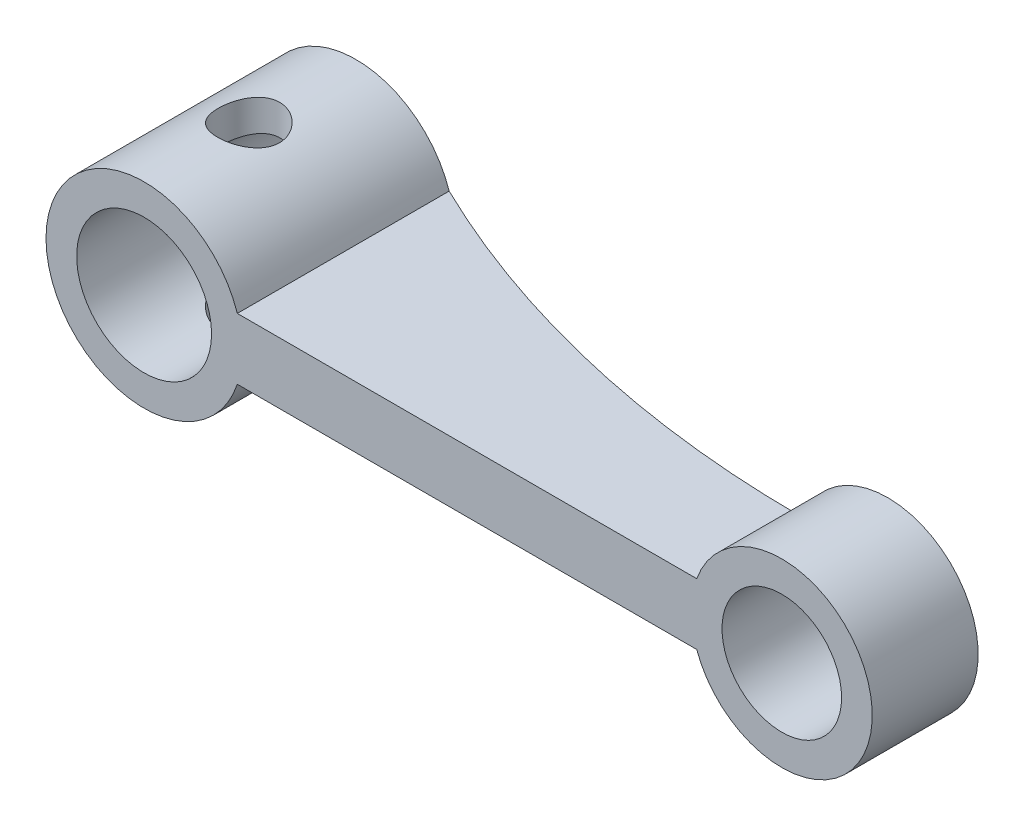
ISO-10303-21;
HEADER;
FILE_DESCRIPTION(('STEP AP214'),'2;1');
FILE_NAME('part.step','',(''),(''),'','','');
FILE_SCHEMA(('AUTOMOTIVE_DESIGN { 1 0 10303 214 1 1 1 1 }'));
ENDSEC;
DATA;
#1=APPLICATION_CONTEXT('core data for automotive mechanical design processes');
#2=APPLICATION_PROTOCOL_DEFINITION('international standard','automotive_design',2000,#1);
#3=PRODUCT_CONTEXT('',#1,'mechanical');
#4=PRODUCT('Part','Part','',(#3));
#5=PRODUCT_RELATED_PRODUCT_CATEGORY('part','',(#4));
#6=PRODUCT_DEFINITION_FORMATION('','',#4);
#7=PRODUCT_DEFINITION_CONTEXT('part definition',#1,'design');
#8=PRODUCT_DEFINITION('design','',#6,#7);
#9=PRODUCT_DEFINITION_SHAPE('','',#8);
#10=(LENGTH_UNIT() NAMED_UNIT(*) SI_UNIT(.MILLI.,.METRE.));
#11=(NAMED_UNIT(*) PLANE_ANGLE_UNIT() SI_UNIT($,.RADIAN.));
#12=(NAMED_UNIT(*) SI_UNIT($,.STERADIAN.) SOLID_ANGLE_UNIT());
#13=UNCERTAINTY_MEASURE_WITH_UNIT(LENGTH_MEASURE(1.E-05),#10,'distance_accuracy_value','');
#14=(GEOMETRIC_REPRESENTATION_CONTEXT(3) GLOBAL_UNCERTAINTY_ASSIGNED_CONTEXT((#13)) GLOBAL_UNIT_ASSIGNED_CONTEXT((#10,
#11,#12)) REPRESENTATION_CONTEXT('',''));
#15=CARTESIAN_POINT('',(0.,0.,0.));
#16=DIRECTION('',(0.,0.,1.));
#17=DIRECTION('',(1.,0.,0.));
#18=AXIS2_PLACEMENT_3D('',#15,#16,#17);
#19=CARTESIAN_POINT('',(-20.8,0.,6.91));
#20=DIRECTION('',(0.,0.,1.));
#21=DIRECTION('',(1.,0.,0.));
#22=AXIS2_PLACEMENT_3D('',#19,#20,#21);
#23=PLANE('',#22);
#24=CARTESIAN_POINT('',(0.,0.,6.91));
#25=DIRECTION('',(0.,0.,1.));
#26=DIRECTION('',(1.,0.,0.));
#27=AXIS2_PLACEMENT_3D('',#24,#25,#26);
#28=CIRCLE('',#27,1.95);
#29=CARTESIAN_POINT('',(1.95,0.,6.91));
#30=VERTEX_POINT('',#29);
#31=EDGE_CURVE('E105',#30,#30,#28,.T.);
#32=ORIENTED_EDGE('',*,*,#31,.F.);
#33=EDGE_LOOP('',(#32));
#34=FACE_BOUND('',#33,.T.);
#35=CARTESIAN_POINT('',(-20.8,0.,6.91));
#36=DIRECTION('',(0.,0.,1.));
#37=DIRECTION('',(1.,0.,0.));
#38=AXIS2_PLACEMENT_3D('',#35,#36,#37);
#39=CIRCLE('',#38,3.2);
#40=CARTESIAN_POINT('',(-17.7602631692859,0.999999999999996,6.91));
#41=VERTEX_POINT('',#40);
#42=CARTESIAN_POINT('',(-17.7602631692859,-1.,6.91));
#43=VERTEX_POINT('',#42);
#44=EDGE_CURVE('E104',#41,#43,#39,.T.);
#45=ORIENTED_EDGE('',*,*,#44,.T.);
#46=DIRECTION('',(1.,0.,0.));
#47=VECTOR('',#46,1.);
#48=CARTESIAN_POINT('',(-17.7602631692859,-1.,6.91));
#49=LINE('',#48,#47);
#50=CARTESIAN_POINT('',(-2.77533781727558,-1.,6.91));
#51=VERTEX_POINT('',#50);
#52=EDGE_CURVE('E97',#43,#51,#49,.T.);
#53=ORIENTED_EDGE('',*,*,#52,.T.);
#54=CARTESIAN_POINT('',(0.,0.,6.91));
#55=DIRECTION('',(0.,0.,1.));
#56=DIRECTION('',(1.,0.,0.));
#57=AXIS2_PLACEMENT_3D('',#54,#55,#56);
#58=CIRCLE('',#57,2.95);
#59=CARTESIAN_POINT('',(-2.77533781727558,0.999999999999998,6.91));
#60=VERTEX_POINT('',#59);
#61=EDGE_CURVE('E158',#51,#60,#58,.T.);
#62=ORIENTED_EDGE('',*,*,#61,.T.);
#63=DIRECTION('',(-1.,0.,0.));
#64=VECTOR('',#63,1.);
#65=CARTESIAN_POINT('',(-17.7602631692859,0.999999999999996,6.91));
#66=LINE('',#65,#64);
#67=EDGE_CURVE('E52',#60,#41,#66,.T.);
#68=ORIENTED_EDGE('',*,*,#67,.T.);
#69=EDGE_LOOP('',(#45,#53,#62,#68));
#70=FACE_BOUND('',#69,.T.);
#71=CARTESIAN_POINT('',(-20.8,0.,6.91));
#72=DIRECTION('',(0.,0.,1.));
#73=DIRECTION('',(1.,0.,0.));
#74=AXIS2_PLACEMENT_3D('',#71,#72,#73);
#75=CIRCLE('',#74,2.2);
#76=CARTESIAN_POINT('',(-18.6,0.,6.91));
#77=VERTEX_POINT('',#76);
#78=EDGE_CURVE('E109',#77,#77,#75,.T.);
#79=ORIENTED_EDGE('',*,*,#78,.F.);
#80=EDGE_LOOP('',(#79));
#81=FACE_BOUND('',#80,.T.);
#82=ADVANCED_FACE('F35',(#34,#70,#81),#23,.T.);
#83=CARTESIAN_POINT('',(-20.8,0.,0.));
#84=DIRECTION('',(0.,0.,1.));
#85=DIRECTION('',(1.,0.,0.));
#86=AXIS2_PLACEMENT_3D('',#83,#84,#85);
#87=PLANE('',#86);
#88=CARTESIAN_POINT('',(-20.8,0.,0.));
#89=DIRECTION('',(0.,0.,1.));
#90=DIRECTION('',(1.,0.,0.));
#91=AXIS2_PLACEMENT_3D('',#88,#89,#90);
#92=CIRCLE('',#91,3.2);
#93=CARTESIAN_POINT('',(-17.7602631692859,0.999999999999996,0.));
#94=VERTEX_POINT('',#93);
#95=CARTESIAN_POINT('',(-17.7602631692859,-1.,0.));
#96=VERTEX_POINT('',#95);
#97=EDGE_CURVE('E93',#94,#96,#92,.T.);
#98=ORIENTED_EDGE('',*,*,#97,.F.);
#99=DIRECTION('',(0.,-1.,0.));
#100=VECTOR('',#99,1.);
#101=CARTESIAN_POINT('',(-17.7602631692859,4.,0.));
#102=LINE('',#101,#100);
#103=EDGE_CURVE('E78',#94,#96,#102,.T.);
#104=ORIENTED_EDGE('',*,*,#103,.T.);
#105=EDGE_LOOP('',(#98,#104));
#106=FACE_BOUND('',#105,.T.);
#107=CARTESIAN_POINT('',(-20.8,0.,0.));
#108=DIRECTION('',(0.,0.,1.));
#109=DIRECTION('',(1.,0.,0.));
#110=AXIS2_PLACEMENT_3D('',#107,#108,#109);
#111=CIRCLE('',#110,2.2);
#112=CARTESIAN_POINT('',(-18.6,0.,0.));
#113=VERTEX_POINT('',#112);
#114=EDGE_CURVE('E153',#113,#113,#111,.T.);
#115=ORIENTED_EDGE('',*,*,#114,.T.);
#116=EDGE_LOOP('',(#115));
#117=FACE_BOUND('',#116,.T.);
#118=ADVANCED_FACE('F90',(#106,#117),#87,.F.);
#119=CARTESIAN_POINT('',(-20.8,0.,6.91));
#120=DIRECTION('',(0.,0.,-1.));
#121=DIRECTION('',(-1.,0.,0.));
#122=AXIS2_PLACEMENT_3D('',#119,#120,#121);
#123=CYLINDRICAL_SURFACE('',#122,3.2);
#124=CARTESIAN_POINT('',(-19.8400657923215,3.052626134483,3.455));
#125=CARTESIAN_POINT('',(-19.8400661769432,3.05262647572289,3.50981856955722));
#126=CARTESIAN_POINT('',(-19.8445883980328,3.05405942740162,3.56464101394872));
#127=CARTESIAN_POINT('',(-19.8625097001257,3.05960742733841,3.67267971879201));
#128=CARTESIAN_POINT('',(-19.8759111126392,3.06372318004542,3.72589555353965));
#129=CARTESIAN_POINT('',(-19.9110954070628,3.07411476593088,3.82914513799746));
#130=CARTESIAN_POINT('',(-19.9328644453536,3.08038702952191,3.87918398531369));
#131=CARTESIAN_POINT('',(-19.9841235768237,3.09435755485059,3.97491599807191));
#132=CARTESIAN_POINT('',(-20.0136149677394,3.1020560562029,4.02060843134075));
#133=CARTESIAN_POINT('',(-20.0804923083181,3.1182564677877,4.10780419308635));
#134=CARTESIAN_POINT('',(-20.1180815800673,3.12677515513293,4.14914851333053));
#135=CARTESIAN_POINT('',(-20.1996561566823,3.14345637869388,4.22505195221916));
#136=CARTESIAN_POINT('',(-20.2436422139722,3.15161887286522,4.25961027153259));
#137=CARTESIAN_POINT('',(-20.3378070215103,3.16681091678736,4.32158635740912));
#138=CARTESIAN_POINT('',(-20.3880875200189,3.1738160047655,4.34885604136949));
#139=CARTESIAN_POINT('',(-20.4927762904632,3.18565277368981,4.39449363236464));
#140=CARTESIAN_POINT('',(-20.5471835580827,3.19048498147088,4.41286369727804));
#141=CARTESIAN_POINT('',(-20.6567568525249,3.19724856887244,4.43962058957542));
#142=CARTESIAN_POINT('',(-20.7118452649788,3.19926636086753,4.44830308691116));
#143=CARTESIAN_POINT('',(-20.8227233117708,3.20039915616633,4.45639273232988));
#144=CARTESIAN_POINT('',(-20.8785127984531,3.1995147608313,4.45580180186076));
#145=CARTESIAN_POINT('',(-20.9873343408336,3.19496161976434,4.44555772047764));
#146=CARTESIAN_POINT('',(-21.0403977020862,3.19138218166585,4.43619293234799));
#147=CARTESIAN_POINT('',(-21.1441383626561,3.18186797736564,4.40915616293206));
#148=CARTESIAN_POINT('',(-21.1948154686525,3.17593302069918,4.39148350985925));
#149=CARTESIAN_POINT('',(-21.2932571958976,3.16215246353641,4.34806067613711));
#150=CARTESIAN_POINT('',(-21.3409638904335,3.15427844024047,4.32218852041611));
#151=CARTESIAN_POINT('',(-21.4314494331828,3.13741823081469,4.26319818228959));
#152=CARTESIAN_POINT('',(-21.4742269635,3.12843174857602,4.23007806884952));
#153=CARTESIAN_POINT('',(-21.5555884778295,3.1098076707598,4.15584836452543));
#154=CARTESIAN_POINT('',(-21.5939122083954,3.10015870632349,4.11445592038676));
#155=CARTESIAN_POINT('',(-21.6631405196173,3.08160287573625,4.02571468064223));
#156=CARTESIAN_POINT('',(-21.6940442710202,3.07269609260371,3.97836522018355));
#157=CARTESIAN_POINT('',(-21.7477822249517,3.05655143778289,3.878435331249));
#158=CARTESIAN_POINT('',(-21.7705395317284,3.04932968248135,3.82581076523347));
#159=CARTESIAN_POINT('',(-21.8067798460492,3.03755852806605,3.71718092505707));
#160=CARTESIAN_POINT('',(-21.8202665474445,3.03300806468788,3.66117700707795));
#161=CARTESIAN_POINT('',(-21.8370536936705,3.027308226483,3.55003960844143));
#162=CARTESIAN_POINT('',(-21.8407789933167,3.02601708994385,3.49497750692785));
#163=CARTESIAN_POINT('',(-21.8391274212912,3.02658477258901,3.3850119984043));
#164=CARTESIAN_POINT('',(-21.8337520295323,3.02844307962525,3.3301085670464));
#165=CARTESIAN_POINT('',(-21.8144202818721,3.03497101581461,3.22377567216811));
#166=CARTESIAN_POINT('',(-21.8007331274369,3.03955235626411,3.17229129603034));
#167=CARTESIAN_POINT('',(-21.7654812157494,3.05093212030668,3.07235779779361));
#168=CARTESIAN_POINT('',(-21.7439151227683,3.05773091980804,3.02390919198603));
#169=CARTESIAN_POINT('',(-21.6927599141868,3.07306228355611,2.92976566332069));
#170=CARTESIAN_POINT('',(-21.6629433594554,3.08164195298574,2.8842021909551));
#171=CARTESIAN_POINT('',(-21.5964076258091,3.09950311137972,2.79857896728866));
#172=CARTESIAN_POINT('',(-21.5596865293112,3.1087847948838,2.75852075031274));
#173=CARTESIAN_POINT('',(-21.4784077715072,3.12755130185936,2.68316619737298));
#174=CARTESIAN_POINT('',(-21.4335699255054,3.13702620367338,2.64816879019882));
#175=CARTESIAN_POINT('',(-21.3384390532917,3.15474580062179,2.58618096103529));
#176=CARTESIAN_POINT('',(-21.288146163052,3.16299052640736,2.55919033953162));
#177=CARTESIAN_POINT('',(-21.1837067960111,3.17734641434556,2.51418847949432));
#178=CARTESIAN_POINT('',(-21.1295814269307,3.18346831186344,2.49613185662772));
#179=CARTESIAN_POINT('',(-21.0188259211717,3.1929922568354,2.46946134155461));
#180=CARTESIAN_POINT('',(-20.9621966021067,3.19639518529227,2.46084439036121));
#181=CARTESIAN_POINT('',(-20.8506519374568,3.20006487565072,2.45356243158542));
#182=CARTESIAN_POINT('',(-20.7957673858087,3.20046000871735,2.4544860450397));
#183=CARTESIAN_POINT('',(-20.6869421022711,3.19846513039526,2.46528167809432));
#184=CARTESIAN_POINT('',(-20.633001291816,3.19607535197872,2.47515294916174));
#185=CARTESIAN_POINT('',(-20.52845131323,3.18888171715903,2.50327442244173));
#186=CARTESIAN_POINT('',(-20.4778029394781,3.18411664793413,2.52138960515084));
#187=CARTESIAN_POINT('',(-20.3802275684456,3.17272858174898,2.56538527982718));
#188=CARTESIAN_POINT('',(-20.333301161318,3.16610529090252,2.5912670001528));
#189=CARTESIAN_POINT('',(-20.2428981165596,3.15147606598877,2.6509991273577));
#190=CARTESIAN_POINT('',(-20.1995758486487,3.14343328057882,2.68507401380763));
#191=CARTESIAN_POINT('',(-20.1191267723107,3.12699549490562,2.75982831792285));
#192=CARTESIAN_POINT('',(-20.0820017616649,3.11860039331867,2.80050964534209));
#193=CARTESIAN_POINT('',(-20.0137570679934,3.10211178310282,2.88893054665447));
#194=CARTESIAN_POINT('',(-19.982877478111,3.09403752004985,2.93685950856766));
#195=CARTESIAN_POINT('',(-19.9296334470951,3.07948502588112,3.0374497272427));
#196=CARTESIAN_POINT('',(-19.9072658390188,3.07300620148841,3.09010921494789));
#197=CARTESIAN_POINT('',(-19.8732184974288,3.06290162190267,3.19430189434474));
#198=CARTESIAN_POINT('',(-19.8608219837082,3.05908783325078,3.2455830987826));
#199=CARTESIAN_POINT('',(-19.8442463815577,3.05395020888312,3.34957522662492));
#200=CARTESIAN_POINT('',(-19.8400654224647,3.05262580634272,3.4022858217885));
#201=CARTESIAN_POINT('',(-19.8400657923215,3.052626134483,3.455));
#202=B_SPLINE_CURVE_WITH_KNOTS('',3,(#124,#125,#126,#127,#128,#129,#130,#131,#132,#133,#134,
#135,#136,#137,#138,#139,#140,#141,#142,#143,#144,#145,#146,#147,#148,#149,#150,#151,#152,#153,
#154,#155,#156,#157,#158,#159,#160,#161,#162,#163,#164,#165,#166,#167,#168,#169,#170,#171,#172,
#173,#174,#175,#176,#177,#178,#179,#180,#181,#182,#183,#184,#185,#186,#187,#188,#189,#190,#191,
#192,#193,#194,#195,#196,#197,#198,#199,#200,#201),.UNSPECIFIED.,.T.,.F.,(4,2,2,2,2,2,2,2,2,2,2,
2,2,2,2,2,2,2,2,2,2,2,2,2,2,2,2,2,2,2,2,2,2,2,2,2,2,2,4),(0.,0.164261554382341,
0.328566257889582,0.492600293311789,0.656661912257404,0.825459634244185,0.994277227201852,
1.1663010872658,1.33828321603493,1.50485909770686,1.67140046542576,1.83265338354258,
1.99391934305771,2.15770676153684,2.32153787026175,2.49243108993271,2.6633433996638,
2.83582889818963,3.00824563036932,3.17302293661992,3.33777345011182,3.49745318870002,
3.65716001061327,3.82180462025493,3.98649502400168,4.15866576386543,4.33083221319226,
4.5021148470496,4.67334195922293,4.83721786517119,5.00108006304146,5.16235006829356,
5.32364559352322,5.49000023428662,5.65640304982571,5.82832642284229,6.00018576787437,
6.15817758002123,6.31613341361828),.UNSPECIFIED.);
#203=CARTESIAN_POINT('',(-19.8400657923215,3.052626134483,3.455));
#204=VERTEX_POINT('',#203);
#205=EDGE_CURVE('E147',#204,#204,#202,.T.);
#206=ORIENTED_EDGE('',*,*,#205,.T.);
#207=EDGE_LOOP('',(#206));
#208=FACE_BOUND('',#207,.T.);
#209=CARTESIAN_POINT('',(-19.8400657923215,-3.05262613448299,3.455));
#210=CARTESIAN_POINT('',(-19.8400661769432,-3.05262647572288,3.40018143044278));
#211=CARTESIAN_POINT('',(-19.8445883980328,-3.05405942740161,3.34535898605128));
#212=CARTESIAN_POINT('',(-19.8625097001257,-3.05960742733841,3.23732028120799));
#213=CARTESIAN_POINT('',(-19.8759111126392,-3.06372318004542,3.18410444646035));
#214=CARTESIAN_POINT('',(-19.9110954070628,-3.07411476593087,3.08085486200254));
#215=CARTESIAN_POINT('',(-19.9328644453536,-3.0803870295219,3.03081601468631));
#216=CARTESIAN_POINT('',(-19.9841235768237,-3.09435755485058,2.93508400192809));
#217=CARTESIAN_POINT('',(-20.0136149677394,-3.1020560562029,2.88939156865925));
#218=CARTESIAN_POINT('',(-20.0804923083181,-3.1182564677877,2.80219580691365));
#219=CARTESIAN_POINT('',(-20.1180815800673,-3.12677515513292,2.76085148666947));
#220=CARTESIAN_POINT('',(-20.1996561566823,-3.14345637869387,2.68494804778084));
#221=CARTESIAN_POINT('',(-20.2436422139722,-3.15161887286522,2.65038972846741));
#222=CARTESIAN_POINT('',(-20.3378070215103,-3.16681091678736,2.58841364259088));
#223=CARTESIAN_POINT('',(-20.3880875200189,-3.17381600476549,2.56114395863051));
#224=CARTESIAN_POINT('',(-20.4927762904632,-3.1856527736898,2.51550636763536));
#225=CARTESIAN_POINT('',(-20.5471835580827,-3.19048498147088,2.49713630272196));
#226=CARTESIAN_POINT('',(-20.6567568525249,-3.19724856887244,2.47037941042458));
#227=CARTESIAN_POINT('',(-20.7118452649788,-3.19926636086753,2.46169691308884));
#228=CARTESIAN_POINT('',(-20.8227233117708,-3.20039915616632,2.45360726767012));
#229=CARTESIAN_POINT('',(-20.8785127984531,-3.19951476083129,2.45419819813924));
#230=CARTESIAN_POINT('',(-20.9873343408336,-3.19496161976434,2.46444227952236));
#231=CARTESIAN_POINT('',(-21.0403977020862,-3.19138218166585,2.47380706765201));
#232=CARTESIAN_POINT('',(-21.1441383626561,-3.18186797736564,2.50084383706794));
#233=CARTESIAN_POINT('',(-21.1948154686525,-3.17593302069917,2.51851649014075));
#234=CARTESIAN_POINT('',(-21.2932571958976,-3.1621524635364,2.56193932386289));
#235=CARTESIAN_POINT('',(-21.3409638904335,-3.15427844024046,2.58781147958389));
#236=CARTESIAN_POINT('',(-21.4314494331828,-3.13741823081468,2.64680181771041));
#237=CARTESIAN_POINT('',(-21.4742269635,-3.12843174857601,2.67992193115048));
#238=CARTESIAN_POINT('',(-21.5555884778295,-3.1098076707598,2.75415163547457));
#239=CARTESIAN_POINT('',(-21.5939122083954,-3.10015870632348,2.79554407961324));
#240=CARTESIAN_POINT('',(-21.6631405196173,-3.08160287573625,2.88428531935777));
#241=CARTESIAN_POINT('',(-21.6940442710202,-3.0726960926037,2.93163477981645));
#242=CARTESIAN_POINT('',(-21.7477822249517,-3.05655143778289,3.031564668751));
#243=CARTESIAN_POINT('',(-21.7705395317284,-3.04932968248134,3.08418923476653));
#244=CARTESIAN_POINT('',(-21.8067798460492,-3.03755852806605,3.19281907494293));
#245=CARTESIAN_POINT('',(-21.8202665474445,-3.03300806468787,3.24882299292205));
#246=CARTESIAN_POINT('',(-21.8370536936705,-3.02730822648299,3.35996039155857));
#247=CARTESIAN_POINT('',(-21.8407789933167,-3.02601708994385,3.41502249307215));
#248=CARTESIAN_POINT('',(-21.8391274212912,-3.026584772589,3.5249880015957));
#249=CARTESIAN_POINT('',(-21.8337520295323,-3.02844307962525,3.5798914329536));
#250=CARTESIAN_POINT('',(-21.8144202818721,-3.03497101581461,3.68622432783189));
#251=CARTESIAN_POINT('',(-21.8007331274369,-3.03955235626411,3.73770870396966));
#252=CARTESIAN_POINT('',(-21.7654812157494,-3.05093212030667,3.83764220220639));
#253=CARTESIAN_POINT('',(-21.7439151227683,-3.05773091980803,3.88609080801397));
#254=CARTESIAN_POINT('',(-21.6927599141868,-3.07306228355611,3.98023433667931));
#255=CARTESIAN_POINT('',(-21.6629433594554,-3.08164195298574,4.0257978090449));
#256=CARTESIAN_POINT('',(-21.5964076258091,-3.09950311137972,4.11142103271133));
#257=CARTESIAN_POINT('',(-21.5596865293112,-3.10878479488379,4.15147924968726));
#258=CARTESIAN_POINT('',(-21.4784077715072,-3.12755130185935,4.22683380262702));
#259=CARTESIAN_POINT('',(-21.4335699255054,-3.13702620367337,4.26183120980118));
#260=CARTESIAN_POINT('',(-21.3384390532917,-3.15474580062179,4.32381903896471));
#261=CARTESIAN_POINT('',(-21.288146163052,-3.16299052640735,4.35080966046838));
#262=CARTESIAN_POINT('',(-21.1837067960111,-3.17734641434556,4.39581152050568));
#263=CARTESIAN_POINT('',(-21.1295814269307,-3.18346831186343,4.41386814337228));
#264=CARTESIAN_POINT('',(-21.0188259211717,-3.19299225683539,4.44053865844539));
#265=CARTESIAN_POINT('',(-20.9621966021068,-3.19639518529226,4.44915560963879));
#266=CARTESIAN_POINT('',(-20.8506519374569,-3.20006487565072,4.45643756841458));
#267=CARTESIAN_POINT('',(-20.7957673858087,-3.20046000871734,4.4555139549603));
#268=CARTESIAN_POINT('',(-20.6869421022711,-3.19846513039526,4.44471832190568));
#269=CARTESIAN_POINT('',(-20.633001291816,-3.19607535197872,4.43484705083826));
#270=CARTESIAN_POINT('',(-20.52845131323,-3.18888171715903,4.40672557755827));
#271=CARTESIAN_POINT('',(-20.4778029394781,-3.18411664793412,4.38861039484916));
#272=CARTESIAN_POINT('',(-20.3802275684456,-3.17272858174897,4.34461472017282));
#273=CARTESIAN_POINT('',(-20.333301161318,-3.16610529090251,4.3187329998472));
#274=CARTESIAN_POINT('',(-20.2428981165596,-3.15147606598877,4.2590008726423));
#275=CARTESIAN_POINT('',(-20.1995758486487,-3.14343328057882,4.22492598619236));
#276=CARTESIAN_POINT('',(-20.1191267723107,-3.12699549490562,4.15017168207715));
#277=CARTESIAN_POINT('',(-20.0820017616649,-3.11860039331866,4.10949035465791));
#278=CARTESIAN_POINT('',(-20.0137570679934,-3.10211178310282,4.02106945334553));
#279=CARTESIAN_POINT('',(-19.982877478111,-3.09403752004985,3.97314049143233));
#280=CARTESIAN_POINT('',(-19.9296334470951,-3.07948502588111,3.8725502727573));
#281=CARTESIAN_POINT('',(-19.9072658390188,-3.0730062014884,3.81989078505211));
#282=CARTESIAN_POINT('',(-19.8732184974288,-3.06290162190266,3.71569810565526));
#283=CARTESIAN_POINT('',(-19.8608219837082,-3.05908783325078,3.6644169012174));
#284=CARTESIAN_POINT('',(-19.8442463815577,-3.05395020888311,3.56042477337508));
#285=CARTESIAN_POINT('',(-19.8400654224647,-3.05262580634271,3.5077141782115));
#286=CARTESIAN_POINT('',(-19.8400657923215,-3.05262613448299,3.455));
#287=B_SPLINE_CURVE_WITH_KNOTS('',3,(#209,#210,#211,#212,#213,#214,#215,#216,#217,#218,#219,
#220,#221,#222,#223,#224,#225,#226,#227,#228,#229,#230,#231,#232,#233,#234,#235,#236,#237,#238,
#239,#240,#241,#242,#243,#244,#245,#246,#247,#248,#249,#250,#251,#252,#253,#254,#255,#256,#257,
#258,#259,#260,#261,#262,#263,#264,#265,#266,#267,#268,#269,#270,#271,#272,#273,#274,#275,#276,
#277,#278,#279,#280,#281,#282,#283,#284,#285,#286),.UNSPECIFIED.,.T.,.F.,(4,2,2,2,2,2,2,2,2,2,2,
2,2,2,2,2,2,2,2,2,2,2,2,2,2,2,2,2,2,2,2,2,2,2,2,2,2,2,4),(0.,0.164261554382341,
0.328566257889582,0.492600293311786,0.656661912257404,0.825459634244182,0.994277227201851,
1.1663010872658,1.33828321603493,1.50485909770686,1.67140046542576,1.83265338354258,
1.99391934305771,2.15770676153684,2.32153787026175,2.4924310899327,2.6633433996638,
2.83582889818963,3.00824563036932,3.17302293661992,3.33777345011183,3.49745318870002,
3.65716001061327,3.82180462025493,3.98649502400168,4.15866576386543,4.33083221319227,
4.5021148470496,4.67334195922293,4.83721786517119,5.00108006304147,5.16235006829357,
5.32364559352323,5.49000023428663,5.65640304982572,5.82832642284229,6.00018576787437,
6.15817758002124,6.31613341361829),.UNSPECIFIED.);
#288=CARTESIAN_POINT('',(-19.8400657923215,-3.05262613448299,3.455));
#289=VERTEX_POINT('',#288);
#290=EDGE_CURVE('E143',#289,#289,#287,.T.);
#291=ORIENTED_EDGE('',*,*,#290,.T.);
#292=EDGE_LOOP('',(#291));
#293=FACE_BOUND('',#292,.T.);
#294=ORIENTED_EDGE('',*,*,#97,.T.);
#295=DIRECTION('',(0.,0.,-1.));
#296=VECTOR('',#295,1.);
#297=CARTESIAN_POINT('',(-17.7602631692859,-1.,6.91));
#298=LINE('',#297,#296);
#299=EDGE_CURVE('E45',#43,#96,#298,.T.);
#300=ORIENTED_EDGE('',*,*,#299,.F.);
#301=ORIENTED_EDGE('',*,*,#44,.F.);
#302=DIRECTION('',(0.,0.,-1.));
#303=VECTOR('',#302,1.);
#304=CARTESIAN_POINT('',(-17.7602631692859,0.999999999999996,6.91));
#305=LINE('',#304,#303);
#306=EDGE_CURVE('E103',#41,#94,#305,.T.);
#307=ORIENTED_EDGE('',*,*,#306,.T.);
#308=EDGE_LOOP('',(#294,#300,#301,#307));
#309=FACE_BOUND('',#308,.T.);
#310=ADVANCED_FACE('F37',(#208,#293,#309),#123,.T.);
#311=CARTESIAN_POINT('',(-17.7602631692859,-1.,6.91));
#312=DIRECTION('',(0.,1.,0.));
#313=DIRECTION('',(-1.,0.,0.));
#314=AXIS2_PLACEMENT_3D('',#311,#312,#313);
#315=PLANE('',#314);
#316=ORIENTED_EDGE('',*,*,#299,.T.);
#317=CARTESIAN_POINT('',(-2.77533781727558,-1.,-30.768590854605));
#318=DIRECTION('',(0.,1.,0.));
#319=DIRECTION('',(-1.,0.,0.));
#320=AXIS2_PLACEMENT_3D('',#317,#318,#319);
#321=CIRCLE('',#320,34.223590854605);
#322=CARTESIAN_POINT('',(-2.77533781727558,-1.,3.455));
#323=VERTEX_POINT('',#322);
#324=EDGE_CURVE('E74',#96,#323,#321,.T.);
#325=ORIENTED_EDGE('',*,*,#324,.T.);
#326=DIRECTION('',(0.,0.,-1.));
#327=VECTOR('',#326,1.);
#328=CARTESIAN_POINT('',(-2.77533781727558,-1.,6.91));
#329=LINE('',#328,#327);
#330=EDGE_CURVE('E100',#51,#323,#329,.T.);
#331=ORIENTED_EDGE('',*,*,#330,.F.);
#332=ORIENTED_EDGE('',*,*,#52,.F.);
#333=EDGE_LOOP('',(#316,#325,#331,#332));
#334=FACE_BOUND('',#333,.T.);
#335=ADVANCED_FACE('F96',(#334),#315,.F.);
#336=CARTESIAN_POINT('',(0.,0.,6.91));
#337=DIRECTION('',(0.,0.,-1.));
#338=DIRECTION('',(-1.,0.,0.));
#339=AXIS2_PLACEMENT_3D('',#336,#337,#338);
#340=CYLINDRICAL_SURFACE('',#339,2.95);
#341=CARTESIAN_POINT('',(0.,0.,3.455));
#342=DIRECTION('',(0.,0.,1.));
#343=DIRECTION('',(1.,0.,0.));
#344=AXIS2_PLACEMENT_3D('',#341,#342,#343);
#345=CIRCLE('',#344,2.95);
#346=CARTESIAN_POINT('',(-2.77533781727558,1.,3.455));
#347=VERTEX_POINT('',#346);
#348=EDGE_CURVE('E86',#323,#347,#345,.T.);
#349=ORIENTED_EDGE('',*,*,#348,.T.);
#350=DIRECTION('',(0.,0.,-1.));
#351=VECTOR('',#350,1.);
#352=CARTESIAN_POINT('',(-2.77533781727558,0.999999999999998,6.91));
#353=LINE('',#352,#351);
#354=EDGE_CURVE('E115',#60,#347,#353,.T.);
#355=ORIENTED_EDGE('',*,*,#354,.F.);
#356=ORIENTED_EDGE('',*,*,#61,.F.);
#357=ORIENTED_EDGE('',*,*,#330,.T.);
#358=EDGE_LOOP('',(#349,#355,#356,#357));
#359=FACE_BOUND('',#358,.T.);
#360=ADVANCED_FACE('F163',(#359),#340,.T.);
#361=CARTESIAN_POINT('',(-17.7602631692859,0.999999999999996,6.91));
#362=DIRECTION('',(0.,-1.,0.));
#363=DIRECTION('',(1.,0.,0.));
#364=AXIS2_PLACEMENT_3D('',#361,#362,#363);
#365=PLANE('',#364);
#366=ORIENTED_EDGE('',*,*,#354,.T.);
#367=CARTESIAN_POINT('',(-2.77533781727558,0.999999999999998,-30.768590854605));
#368=DIRECTION('',(0.,-1.,0.));
#369=DIRECTION('',(1.,0.,0.));
#370=AXIS2_PLACEMENT_3D('',#367,#368,#369);
#371=CIRCLE('',#370,34.223590854605);
#372=EDGE_CURVE('E11',#347,#94,#371,.T.);
#373=ORIENTED_EDGE('',*,*,#372,.T.);
#374=ORIENTED_EDGE('',*,*,#306,.F.);
#375=ORIENTED_EDGE('',*,*,#67,.F.);
#376=EDGE_LOOP('',(#366,#373,#374,#375));
#377=FACE_BOUND('',#376,.T.);
#378=ADVANCED_FACE('F165',(#377),#365,.F.);
#379=CARTESIAN_POINT('',(0.,0.,6.91));
#380=DIRECTION('',(0.,0.,-1.));
#381=DIRECTION('',(-1.,0.,0.));
#382=AXIS2_PLACEMENT_3D('',#379,#380,#381);
#383=CYLINDRICAL_SURFACE('',#382,1.95);
#384=CARTESIAN_POINT('',(0.,0.,3.455));
#385=DIRECTION('',(0.,0.,1.));
#386=DIRECTION('',(1.,0.,0.));
#387=AXIS2_PLACEMENT_3D('',#384,#385,#386);
#388=CIRCLE('',#387,1.95);
#389=CARTESIAN_POINT('',(1.95,0.,3.455));
#390=VERTEX_POINT('',#389);
#391=EDGE_CURVE('E168',#390,#390,#388,.T.);
#392=ORIENTED_EDGE('',*,*,#391,.F.);
#393=EDGE_LOOP('',(#392));
#394=FACE_BOUND('',#393,.T.);
#395=ORIENTED_EDGE('',*,*,#31,.T.);
#396=EDGE_LOOP('',(#395));
#397=FACE_BOUND('',#396,.T.);
#398=ADVANCED_FACE('F174',(#394,#397),#383,.F.);
#399=CARTESIAN_POINT('',(-20.8,0.,6.91));
#400=DIRECTION('',(0.,0.,-1.));
#401=DIRECTION('',(-1.,0.,0.));
#402=AXIS2_PLACEMENT_3D('',#399,#400,#401);
#403=CYLINDRICAL_SURFACE('',#402,2.2);
#404=CARTESIAN_POINT('',(-19.8400657923215,1.97952679116212,3.455));
#405=CARTESIAN_POINT('',(-19.8400723724332,1.97953347470959,3.50812561670416));
#406=CARTESIAN_POINT('',(-19.8443248440489,1.98161003307814,3.56131313834005));
#407=CARTESIAN_POINT('',(-19.8611605334638,1.98963842473993,3.6661335719463));
#408=CARTESIAN_POINT('',(-19.873764014743,1.99559968356256,3.71776238235527));
#409=CARTESIAN_POINT('',(-19.9067024696461,2.01055780387089,3.81775545221366));
#410=CARTESIAN_POINT('',(-19.927003976076,2.01954150647547,3.86613279056393));
#411=CARTESIAN_POINT('',(-19.9746701223836,2.0394841324757,3.95879287270745));
#412=CARTESIAN_POINT('',(-20.0020339597115,2.05044283139384,4.00307608097375));
#413=CARTESIAN_POINT('',(-20.0650724211859,2.07390451714532,4.08936213449852));
#414=CARTESIAN_POINT('',(-20.1011599067983,2.0864612261859,4.13104895232928));
#415=CARTESIAN_POINT('',(-20.1797669160561,2.11116261983446,4.20801578917234));
#416=CARTESIAN_POINT('',(-20.2222888859031,2.12330714558353,4.24329336030496));
#417=CARTESIAN_POINT('',(-20.3149165131005,2.14640849808412,4.30796397480766));
#418=CARTESIAN_POINT('',(-20.3652763814546,2.15728785881223,4.33702305464194));
#419=CARTESIAN_POINT('',(-20.4707552602774,2.17588099965349,4.38612208339949));
#420=CARTESIAN_POINT('',(-20.525871657267,2.18359650491363,4.40616694805761));
#421=CARTESIAN_POINT('',(-20.6356506624515,2.19450236766974,4.43542763189687));
#422=CARTESIAN_POINT('',(-20.6901294312535,2.19794368568094,4.44523793915542));
#423=CARTESIAN_POINT('',(-20.8000531681607,2.200685662518,4.45572147423219));
#424=CARTESIAN_POINT('',(-20.8554977062421,2.19998811950585,4.45639866958704));
#425=CARTESIAN_POINT('',(-20.9618551246099,2.19464160264249,4.44889161366988));
#426=CARTESIAN_POINT('',(-21.0128243980669,2.19025815941587,4.44129295062992));
#427=CARTESIAN_POINT('',(-21.1126295280609,2.17825396394375,4.41849883630158));
#428=CARTESIAN_POINT('',(-21.161465173316,2.17063289189076,4.40330263451499));
#429=CARTESIAN_POINT('',(-21.2568846682029,2.15259561876601,4.36546984294736));
#430=CARTESIAN_POINT('',(-21.3033948764975,2.14212135370825,4.34267620445395));
#431=CARTESIAN_POINT('',(-21.3920316661359,2.11933857128108,4.2904535498827));
#432=CARTESIAN_POINT('',(-21.4341565315955,2.10702934047877,4.26102195067898));
#433=CARTESIAN_POINT('',(-21.5166590865126,2.08048898870714,4.19344597062703));
#434=CARTESIAN_POINT('',(-21.5565796745121,2.06618352508235,4.15477189199331));
#435=CARTESIAN_POINT('',(-21.6295655343806,2.03797818995156,4.07125355071233));
#436=CARTESIAN_POINT('',(-21.6626268666853,2.02407855544654,4.02640576670223));
#437=CARTESIAN_POINT('',(-21.7223124149314,1.99761186531567,3.92936491932797));
#438=CARTESIAN_POINT('',(-21.7485971964481,1.98512822191385,3.87693836717195));
#439=CARTESIAN_POINT('',(-21.7917471489377,1.96393037650395,3.76764212562529));
#440=CARTESIAN_POINT('',(-21.8086218058105,1.95521238053174,3.7107769767525));
#441=CARTESIAN_POINT('',(-21.8311149192001,1.94343802347817,3.59918727428922));
#442=CARTESIAN_POINT('',(-21.837543205664,1.93997588520767,3.54466979591343));
#443=CARTESIAN_POINT('',(-21.8413662090799,1.93792762609418,3.4352386406892));
#444=CARTESIAN_POINT('',(-21.8387653591787,1.93933911238558,3.38032517147819));
#445=CARTESIAN_POINT('',(-21.8253214117446,1.94647449696171,3.27680286357846));
#446=CARTESIAN_POINT('',(-21.8152275490077,1.95180599291288,3.22806593584933));
#447=CARTESIAN_POINT('',(-21.7881098148077,1.96567271253587,3.13304470218314));
#448=CARTESIAN_POINT('',(-21.7710840196039,1.97420882549741,3.08676108111749));
#449=CARTESIAN_POINT('',(-21.7296563448446,1.99406373003329,2.9953561831881));
#450=CARTESIAN_POINT('',(-21.7049272501515,2.00550064682631,2.9504097300284));
#451=CARTESIAN_POINT('',(-21.6491208695441,2.02975835269222,2.86505683684882));
#452=CARTESIAN_POINT('',(-21.6180404034121,2.0425798335125,2.82465268699386));
#453=CARTESIAN_POINT('',(-21.5464354987447,2.0698927072393,2.7449173065555));
#454=CARTESIAN_POINT('',(-21.5052497981631,2.08441330476654,2.70618730114614));
#455=CARTESIAN_POINT('',(-21.416694016633,2.11230738532971,2.63604282254106));
#456=CARTESIAN_POINT('',(-21.369322513762,2.12568060344419,2.60463003598118));
#457=CARTESIAN_POINT('',(-21.2685539487006,2.1501600287254,2.5496007209276));
#458=CARTESIAN_POINT('',(-21.2150665074657,2.16122281808255,2.52612910715909));
#459=CARTESIAN_POINT('',(-21.1042441173403,2.17958266468322,2.48875871575758));
#460=CARTESIAN_POINT('',(-21.0469120532468,2.1868825104848,2.47485284679285));
#461=CARTESIAN_POINT('',(-20.9350796485292,2.19650712358837,2.45805246110595));
#462=CARTESIAN_POINT('',(-20.8807309852263,2.1991898280278,2.45435067749486));
#463=CARTESIAN_POINT('',(-20.772113451902,2.20049282725963,2.45583547794378));
#464=CARTESIAN_POINT('',(-20.7178445635711,2.19911427819955,2.46101953222993));
#465=CARTESIAN_POINT('',(-20.6140086218675,2.19270824700737,2.47953626872633));
#466=CARTESIAN_POINT('',(-20.5643461566793,2.187882603393,2.4924120282024));
#467=CARTESIAN_POINT('',(-20.4678974020855,2.17533325468173,2.52543546570601));
#468=CARTESIAN_POINT('',(-20.4211115503378,2.16760910986045,2.5455842470879));
#469=CARTESIAN_POINT('',(-20.3296543765233,2.14965911879418,2.59346017693022));
#470=CARTESIAN_POINT('',(-20.2851427651518,2.13934547564973,2.62145849909002));
#471=CARTESIAN_POINT('',(-20.2012374077675,2.11739633982583,2.6838740683971));
#472=CARTESIAN_POINT('',(-20.1618457550193,2.10576031011789,2.71829392703282));
#473=CARTESIAN_POINT('',(-20.0859933920122,2.08132346206459,2.79579927626903));
#474=CARTESIAN_POINT('',(-20.0500210649068,2.06850406750484,2.83935834462389));
#475=CARTESIAN_POINT('',(-19.9857586430872,2.04406385277807,2.93217474509529));
#476=CARTESIAN_POINT('',(-19.9574736457451,2.03244383105154,2.98143582743191));
#477=CARTESIAN_POINT('',(-19.9092078179271,2.01176276714849,3.08511938838341));
#478=CARTESIAN_POINT('',(-19.889327686069,2.00273315085587,3.13959536343376));
#479=CARTESIAN_POINT('',(-19.8592777594955,1.98880015541673,3.25155312400962));
#480=CARTESIAN_POINT('',(-19.8490766680777,1.98388348341233,3.30902458345037));
#481=CARTESIAN_POINT('',(-19.8413585247662,1.98015315254576,3.39622622383062));
#482=CARTESIAN_POINT('',(-19.8400621513027,1.97952309290855,3.42560363483521));
#483=CARTESIAN_POINT('',(-19.8400657923215,1.97952679116212,3.455));
#484=B_SPLINE_CURVE_WITH_KNOTS('',3,(#404,#405,#406,#407,#408,#409,#410,#411,#412,#413,#414,
#415,#416,#417,#418,#419,#420,#421,#422,#423,#424,#425,#426,#427,#428,#429,#430,#431,#432,#433,
#434,#435,#436,#437,#438,#439,#440,#441,#442,#443,#444,#445,#446,#447,#448,#449,#450,#451,#452,
#453,#454,#455,#456,#457,#458,#459,#460,#461,#462,#463,#464,#465,#466,#467,#468,#469,#470,#471,
#472,#473,#474,#475,#476,#477,#478,#479,#480,#481,#482,#483),.UNSPECIFIED.,.T.,.F.,(4,2,2,2,2,2,
2,2,2,2,2,2,2,2,2,2,2,2,2,2,2,2,2,2,2,2,2,2,2,2,2,2,2,2,2,2,2,2,2,4),(0.,0.159280997659189,
0.318949908312416,0.477932471999992,0.63689697715988,0.80580740643439,0.9747822125677,
1.15131836800573,1.32775813563876,1.49325568294976,1.65868133376498,1.81311944164718,
1.96757280821176,2.12544046391471,2.2833696592699,2.45479782346165,2.62632417528075,
2.80525401629526,2.9840031590599,3.14808883439752,3.3120939579568,3.46159545742856,
3.61113847466593,3.76818436598096,3.92530908582716,4.09962763033284,4.27398631599272,
4.4513739250114,4.62862988992154,4.79139472052957,4.95411322012991,5.10801166316758,
5.26193346319916,5.42201928406404,5.58217035055854,5.75516471668862,5.92827351488943,
6.10340127398966,6.2779608166851,6.36609687347812),.UNSPECIFIED.);
#485=CARTESIAN_POINT('',(-19.8400657923215,1.97952679116212,3.455));
#486=VERTEX_POINT('',#485);
#487=EDGE_CURVE('E125',#486,#486,#484,.T.);
#488=ORIENTED_EDGE('',*,*,#487,.F.);
#489=EDGE_LOOP('',(#488));
#490=FACE_BOUND('',#489,.T.);
#491=CARTESIAN_POINT('',(-19.8400657923215,-1.97952679116211,3.455));
#492=CARTESIAN_POINT('',(-19.8400723724332,-1.97953347470958,3.40187438329584));
#493=CARTESIAN_POINT('',(-19.8443248440489,-1.98161003307813,3.34868686165995));
#494=CARTESIAN_POINT('',(-19.8611605334638,-1.98963842473992,3.2438664280537));
#495=CARTESIAN_POINT('',(-19.873764014743,-1.99559968356255,3.19223761764473));
#496=CARTESIAN_POINT('',(-19.9067024696461,-2.01055780387089,3.09224454778634));
#497=CARTESIAN_POINT('',(-19.927003976076,-2.01954150647547,3.04386720943607));
#498=CARTESIAN_POINT('',(-19.9746701223836,-2.03948413247569,2.95120712729255));
#499=CARTESIAN_POINT('',(-20.0020339597115,-2.05044283139384,2.90692391902624));
#500=CARTESIAN_POINT('',(-20.0650724211859,-2.07390451714532,2.82063786550148));
#501=CARTESIAN_POINT('',(-20.1011599067983,-2.08646122618589,2.77895104767072));
#502=CARTESIAN_POINT('',(-20.1797669160561,-2.11116261983446,2.70198421082766));
#503=CARTESIAN_POINT('',(-20.2222888859031,-2.12330714558352,2.66670663969504));
#504=CARTESIAN_POINT('',(-20.3149165131005,-2.14640849808412,2.60203602519234));
#505=CARTESIAN_POINT('',(-20.3652763814546,-2.15728785881223,2.57297694535806));
#506=CARTESIAN_POINT('',(-20.4707552602774,-2.17588099965349,2.52387791660051));
#507=CARTESIAN_POINT('',(-20.525871657267,-2.18359650491363,2.50383305194239));
#508=CARTESIAN_POINT('',(-20.6356506624515,-2.19450236766974,2.47457236810313));
#509=CARTESIAN_POINT('',(-20.6901294312535,-2.19794368568094,2.46476206084458));
#510=CARTESIAN_POINT('',(-20.8000531681607,-2.20068566251799,2.45427852576782));
#511=CARTESIAN_POINT('',(-20.8554977062421,-2.19998811950585,2.45360133041296));
#512=CARTESIAN_POINT('',(-20.9618551246099,-2.19464160264248,2.46110838633012));
#513=CARTESIAN_POINT('',(-21.0128243980669,-2.19025815941586,2.46870704937008));
#514=CARTESIAN_POINT('',(-21.1126295280609,-2.17825396394374,2.49150116369842));
#515=CARTESIAN_POINT('',(-21.161465173316,-2.17063289189076,2.50669736548501));
#516=CARTESIAN_POINT('',(-21.2568846682029,-2.15259561876601,2.54453015705264));
#517=CARTESIAN_POINT('',(-21.3033948764975,-2.14212135370824,2.56732379554605));
#518=CARTESIAN_POINT('',(-21.3920316661359,-2.11933857128107,2.6195464501173));
#519=CARTESIAN_POINT('',(-21.4341565315955,-2.10702934047877,2.64897804932102));
#520=CARTESIAN_POINT('',(-21.5166590865126,-2.08048898870713,2.71655402937297));
#521=CARTESIAN_POINT('',(-21.5565796745121,-2.06618352508234,2.75522810800669));
#522=CARTESIAN_POINT('',(-21.6295655343806,-2.03797818995156,2.83874644928767));
#523=CARTESIAN_POINT('',(-21.6626268666853,-2.02407855544653,2.88359423329777));
#524=CARTESIAN_POINT('',(-21.7223124149314,-1.99761186531567,2.98063508067203));
#525=CARTESIAN_POINT('',(-21.7485971964481,-1.98512822191385,3.03306163282805));
#526=CARTESIAN_POINT('',(-21.7917471489376,-1.96393037650394,3.14235787437471));
#527=CARTESIAN_POINT('',(-21.8086218058105,-1.95521238053174,3.1992230232475));
#528=CARTESIAN_POINT('',(-21.8311149192001,-1.94343802347816,3.31081272571078));
#529=CARTESIAN_POINT('',(-21.837543205664,-1.93997588520766,3.36533020408657));
#530=CARTESIAN_POINT('',(-21.8413662090799,-1.93792762609417,3.4747613593108));
#531=CARTESIAN_POINT('',(-21.8387653591787,-1.93933911238558,3.52967482852182));
#532=CARTESIAN_POINT('',(-21.8253214117446,-1.9464744969617,3.63319713642155));
#533=CARTESIAN_POINT('',(-21.8152275490077,-1.95180599291287,3.68193406415067));
#534=CARTESIAN_POINT('',(-21.7881098148077,-1.96567271253587,3.77695529781687));
#535=CARTESIAN_POINT('',(-21.7710840196039,-1.97420882549741,3.82323891888251));
#536=CARTESIAN_POINT('',(-21.7296563448446,-1.99406373003328,3.9146438168119));
#537=CARTESIAN_POINT('',(-21.7049272501515,-2.00550064682631,3.9595902699716));
#538=CARTESIAN_POINT('',(-21.6491208695441,-2.02975835269221,4.04494316315118));
#539=CARTESIAN_POINT('',(-21.6180404034121,-2.0425798335125,4.08534731300614));
#540=CARTESIAN_POINT('',(-21.5464354987447,-2.0698927072393,4.1650826934445));
#541=CARTESIAN_POINT('',(-21.5052497981631,-2.08441330476654,4.20381269885386));
#542=CARTESIAN_POINT('',(-21.416694016633,-2.1123073853297,4.27395717745894));
#543=CARTESIAN_POINT('',(-21.369322513762,-2.12568060344418,4.30536996401882));
#544=CARTESIAN_POINT('',(-21.2685539487006,-2.15016002872539,4.3603992790724));
#545=CARTESIAN_POINT('',(-21.2150665074657,-2.16122281808255,4.38387089284091));
#546=CARTESIAN_POINT('',(-21.1042441173403,-2.17958266468321,4.42124128424243));
#547=CARTESIAN_POINT('',(-21.0469120532468,-2.1868825104848,4.43514715320716));
#548=CARTESIAN_POINT('',(-20.9350796485292,-2.19650712358836,4.45194753889405));
#549=CARTESIAN_POINT('',(-20.8807309852263,-2.19918982802779,4.45564932250514));
#550=CARTESIAN_POINT('',(-20.772113451902,-2.20049282725963,4.45416452205622));
#551=CARTESIAN_POINT('',(-20.7178445635711,-2.19911427819954,4.44898046777007));
#552=CARTESIAN_POINT('',(-20.6140086218675,-2.19270824700736,4.43046373127367));
#553=CARTESIAN_POINT('',(-20.5643461566793,-2.18788260339299,4.4175879717976));
#554=CARTESIAN_POINT('',(-20.4678974020855,-2.17533325468173,4.38456453429399));
#555=CARTESIAN_POINT('',(-20.4211115503378,-2.16760910986045,4.3644157529121));
#556=CARTESIAN_POINT('',(-20.3296543765233,-2.14965911879418,4.31653982306978));
#557=CARTESIAN_POINT('',(-20.2851427651518,-2.13934547564973,4.28854150090998));
#558=CARTESIAN_POINT('',(-20.2012374077675,-2.11739633982583,4.22612593160291));
#559=CARTESIAN_POINT('',(-20.1618457550193,-2.10576031011789,4.19170607296718));
#560=CARTESIAN_POINT('',(-20.0859933920122,-2.08132346206459,4.11420072373097));
#561=CARTESIAN_POINT('',(-20.0500210649068,-2.06850406750483,4.07064165537611));
#562=CARTESIAN_POINT('',(-19.9857586430872,-2.04406385277806,3.97782525490471));
#563=CARTESIAN_POINT('',(-19.9574736457451,-2.03244383105153,3.92856417256809));
#564=CARTESIAN_POINT('',(-19.9092078179271,-2.01176276714849,3.82488061161659));
#565=CARTESIAN_POINT('',(-19.889327686069,-2.00273315085587,3.77040463656624));
#566=CARTESIAN_POINT('',(-19.8592777594955,-1.98880015541673,3.65844687599038));
#567=CARTESIAN_POINT('',(-19.8490766680777,-1.98388348341233,3.60097541654963));
#568=CARTESIAN_POINT('',(-19.8413585247662,-1.98015315254575,3.51377377616938));
#569=CARTESIAN_POINT('',(-19.8400621513027,-1.97952309290854,3.48439636516479));
#570=CARTESIAN_POINT('',(-19.8400657923215,-1.97952679116211,3.455));
#571=B_SPLINE_CURVE_WITH_KNOTS('',3,(#491,#492,#493,#494,#495,#496,#497,#498,#499,#500,#501,
#502,#503,#504,#505,#506,#507,#508,#509,#510,#511,#512,#513,#514,#515,#516,#517,#518,#519,#520,
#521,#522,#523,#524,#525,#526,#527,#528,#529,#530,#531,#532,#533,#534,#535,#536,#537,#538,#539,
#540,#541,#542,#543,#544,#545,#546,#547,#548,#549,#550,#551,#552,#553,#554,#555,#556,#557,#558,
#559,#560,#561,#562,#563,#564,#565,#566,#567,#568,#569,#570),.UNSPECIFIED.,.T.,.F.,(4,2,2,2,2,2,
2,2,2,2,2,2,2,2,2,2,2,2,2,2,2,2,2,2,2,2,2,2,2,2,2,2,2,2,2,2,2,2,2,4),(0.,0.159280997659189,
0.318949908312416,0.477932471999992,0.63689697715988,0.80580740643439,0.9747822125677,
1.15131836800573,1.32775813563876,1.49325568294976,1.65868133376498,1.81311944164718,
1.96757280821176,2.1254404639147,2.2833696592699,2.45479782346165,2.62632417528075,
2.80525401629526,2.9840031590599,3.14808883439752,3.3120939579568,3.46159545742856,
3.61113847466593,3.76818436598096,3.92530908582716,4.09962763033284,4.27398631599273,
4.4513739250114,4.62862988992154,4.79139472052958,4.95411322012991,5.10801166316759,
5.26193346319916,5.42201928406404,5.58217035055854,5.75516471668862,5.92827351488943,
6.10340127398966,6.2779608166851,6.36609687347812),.UNSPECIFIED.);
#572=CARTESIAN_POINT('',(-19.8400657923215,-1.97952679116211,3.455));
#573=VERTEX_POINT('',#572);
#574=EDGE_CURVE('E85',#573,#573,#571,.T.);
#575=ORIENTED_EDGE('',*,*,#574,.F.);
#576=EDGE_LOOP('',(#575));
#577=FACE_BOUND('',#576,.T.);
#578=ORIENTED_EDGE('',*,*,#78,.T.);
#579=EDGE_LOOP('',(#578));
#580=FACE_BOUND('',#579,.T.);
#581=ORIENTED_EDGE('',*,*,#114,.F.);
#582=EDGE_LOOP('',(#581));
#583=FACE_BOUND('',#582,.T.);
#584=ADVANCED_FACE('F128',(#490,#577,#580,#583),#403,.F.);
#585=CARTESIAN_POINT('',(-20.8400657923215,9.,3.455));
#586=DIRECTION('',(0.,-1.,0.));
#587=DIRECTION('',(1.,0.,0.));
#588=AXIS2_PLACEMENT_3D('',#585,#586,#587);
#589=CYLINDRICAL_SURFACE('',#588,1.);
#590=ORIENTED_EDGE('',*,*,#574,.T.);
#591=EDGE_LOOP('',(#590));
#592=FACE_BOUND('',#591,.T.);
#593=ORIENTED_EDGE('',*,*,#290,.F.);
#594=EDGE_LOOP('',(#593));
#595=FACE_BOUND('',#594,.T.);
#596=ADVANCED_FACE('F135',(#592,#595),#589,.F.);
#597=ORIENTED_EDGE('',*,*,#487,.T.);
#598=EDGE_LOOP('',(#597));
#599=FACE_BOUND('',#598,.T.);
#600=ORIENTED_EDGE('',*,*,#205,.F.);
#601=EDGE_LOOP('',(#600));
#602=FACE_BOUND('',#601,.T.);
#603=ADVANCED_FACE('F131',(#599,#602),#589,.F.);
#604=CARTESIAN_POINT('',(-2.77533781727558,4.,-30.768590854605));
#605=DIRECTION('',(0.,-1.,0.));
#606=DIRECTION('',(1.,0.,0.));
#607=AXIS2_PLACEMENT_3D('',#604,#605,#606);
#608=CYLINDRICAL_SURFACE('',#607,34.223590854605);
#609=ORIENTED_EDGE('',*,*,#103,.F.);
#610=ORIENTED_EDGE('',*,*,#372,.F.);
#611=DIRECTION('',(0.,-1.,0.));
#612=VECTOR('',#611,1.);
#613=CARTESIAN_POINT('',(-2.77533781727558,4.,3.455));
#614=LINE('',#613,#612);
#615=EDGE_CURVE('E80',#347,#323,#614,.T.);
#616=ORIENTED_EDGE('',*,*,#615,.T.);
#617=ORIENTED_EDGE('',*,*,#324,.F.);
#618=EDGE_LOOP('',(#609,#610,#616,#617));
#619=FACE_BOUND('',#618,.T.);
#620=ADVANCED_FACE('F76',(#619),#608,.F.);
#621=CARTESIAN_POINT('',(-2.77533781727558,4.,3.455));
#622=DIRECTION('',(0.,0.,1.));
#623=DIRECTION('',(1.,0.,0.));
#624=AXIS2_PLACEMENT_3D('',#621,#622,#623);
#625=PLANE('',#624);
#626=ORIENTED_EDGE('',*,*,#391,.T.);
#627=EDGE_LOOP('',(#626));
#628=FACE_BOUND('',#627,.T.);
#629=ORIENTED_EDGE('',*,*,#348,.F.);
#630=ORIENTED_EDGE('',*,*,#615,.F.);
#631=EDGE_LOOP('',(#629,#630));
#632=FACE_BOUND('',#631,.T.);
#633=ADVANCED_FACE('F167',(#628,#632),#625,.F.);
#634=CLOSED_SHELL('',(#82,#118,#310,#335,#360,#378,#398,#584,#596,#603,#620,#633));
#635=MANIFOLD_SOLID_BREP('B2',#634);
#636=ADVANCED_BREP_SHAPE_REPRESENTATION('',(#18,#635),#14);
#637=SHAPE_DEFINITION_REPRESENTATION(#9,#636);
ENDSEC;
END-ISO-10303-21;
